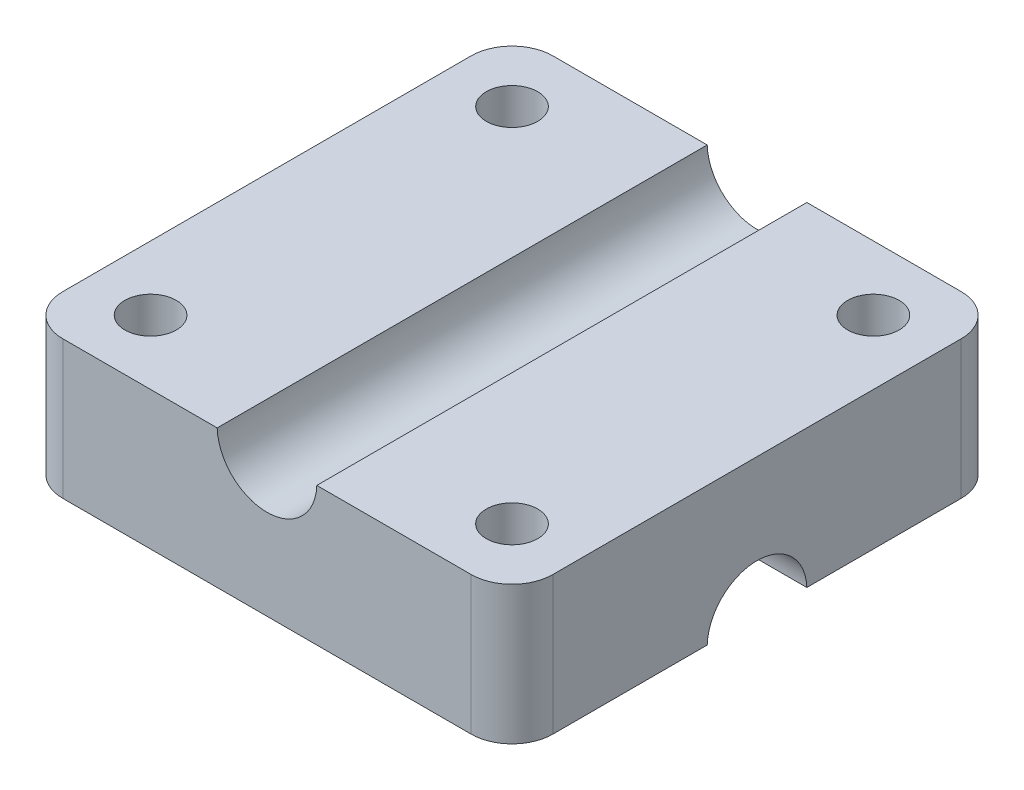
ISO-10303-21;
HEADER;
FILE_DESCRIPTION(('STEP AP214'),'2;1');
FILE_NAME('part.step','',(''),(''),'','','');
FILE_SCHEMA(('AUTOMOTIVE_DESIGN { 1 0 10303 214 1 1 1 1 }'));
ENDSEC;
DATA;
#1=APPLICATION_CONTEXT('core data for automotive mechanical design processes');
#2=APPLICATION_PROTOCOL_DEFINITION('international standard','automotive_design',2000,#1);
#3=PRODUCT_CONTEXT('',#1,'mechanical');
#4=PRODUCT('Part','Part','',(#3));
#5=PRODUCT_RELATED_PRODUCT_CATEGORY('part','',(#4));
#6=PRODUCT_DEFINITION_FORMATION('','',#4);
#7=PRODUCT_DEFINITION_CONTEXT('part definition',#1,'design');
#8=PRODUCT_DEFINITION('design','',#6,#7);
#9=PRODUCT_DEFINITION_SHAPE('','',#8);
#10=(LENGTH_UNIT() NAMED_UNIT(*) SI_UNIT(.MILLI.,.METRE.));
#11=(NAMED_UNIT(*) PLANE_ANGLE_UNIT() SI_UNIT($,.RADIAN.));
#12=(NAMED_UNIT(*) SI_UNIT($,.STERADIAN.) SOLID_ANGLE_UNIT());
#13=UNCERTAINTY_MEASURE_WITH_UNIT(LENGTH_MEASURE(1.E-05),#10,'distance_accuracy_value','');
#14=(GEOMETRIC_REPRESENTATION_CONTEXT(3) GLOBAL_UNCERTAINTY_ASSIGNED_CONTEXT((#13)) GLOBAL_UNIT_ASSIGNED_CONTEXT((#10,
#11,#12)) REPRESENTATION_CONTEXT('',''));
#15=CARTESIAN_POINT('',(0.,0.,0.));
#16=DIRECTION('',(0.,0.,1.));
#17=DIRECTION('',(1.,0.,0.));
#18=AXIS2_PLACEMENT_3D('',#15,#16,#17);
#19=CARTESIAN_POINT('',(0.,0.,0.));
#20=DIRECTION('',(0.,-1.,0.));
#21=DIRECTION('',(0.,0.,-1.));
#22=AXIS2_PLACEMENT_3D('',#19,#20,#21);
#23=PLANE('',#22);
#24=CARTESIAN_POINT('',(-11.24,0.,-11.24));
#25=DIRECTION('',(0.,-1.,0.));
#26=DIRECTION('',(0.,0.,-1.));
#27=AXIS2_PLACEMENT_3D('',#24,#25,#26);
#28=CIRCLE('',#27,1.6);
#29=CARTESIAN_POINT('',(-11.24,0.,-12.84));
#30=VERTEX_POINT('',#29);
#31=EDGE_CURVE('E434',#30,#30,#28,.T.);
#32=ORIENTED_EDGE('',*,*,#31,.F.);
#33=EDGE_LOOP('',(#32));
#34=FACE_BOUND('',#33,.T.);
#35=CARTESIAN_POINT('',(11.24,0.,-11.24));
#36=DIRECTION('',(0.,-1.,0.));
#37=DIRECTION('',(0.,0.,-1.));
#38=AXIS2_PLACEMENT_3D('',#35,#36,#37);
#39=CIRCLE('',#38,1.6);
#40=CARTESIAN_POINT('',(11.24,0.,-12.84));
#41=VERTEX_POINT('',#40);
#42=EDGE_CURVE('E427',#41,#41,#39,.T.);
#43=ORIENTED_EDGE('',*,*,#42,.F.);
#44=EDGE_LOOP('',(#43));
#45=FACE_BOUND('',#44,.T.);
#46=DIRECTION('',(-1.,0.,0.));
#47=VECTOR('',#46,1.);
#48=CARTESIAN_POINT('',(-15.24,0.,-15.24));
#49=LINE('',#48,#47);
#50=CARTESIAN_POINT('',(12.7,0.,-15.24));
#51=VERTEX_POINT('',#50);
#52=CARTESIAN_POINT('',(-12.7,0.,-15.24));
#53=VERTEX_POINT('',#52);
#54=EDGE_CURVE('E148',#51,#53,#49,.T.);
#55=ORIENTED_EDGE('',*,*,#54,.F.);
#56=CARTESIAN_POINT('',(12.7,0.,-12.7));
#57=DIRECTION('',(0.,-1.,0.));
#58=DIRECTION('',(0.,0.,-1.));
#59=AXIS2_PLACEMENT_3D('',#56,#57,#58);
#60=CIRCLE('',#59,2.54);
#61=CARTESIAN_POINT('',(15.24,0.,-12.7));
#62=VERTEX_POINT('',#61);
#63=EDGE_CURVE('E190',#51,#62,#60,.T.);
#64=ORIENTED_EDGE('',*,*,#63,.T.);
#65=DIRECTION('',(0.,0.,-1.));
#66=VECTOR('',#65,1.);
#67=CARTESIAN_POINT('',(15.24,0.,15.24));
#68=LINE('',#67,#66);
#69=CARTESIAN_POINT('',(15.24,0.,-3.09838667696593));
#70=VERTEX_POINT('',#69);
#71=EDGE_CURVE('E258',#70,#62,#68,.T.);
#72=ORIENTED_EDGE('',*,*,#71,.F.);
#73=DIRECTION('',(1.,0.,0.));
#74=VECTOR('',#73,1.);
#75=CARTESIAN_POINT('',(-24.0081240867132,0.,-3.09838667696593));
#76=LINE('',#75,#74);
#77=CARTESIAN_POINT('',(-15.24,0.,-3.09838667696593));
#78=VERTEX_POINT('',#77);
#79=EDGE_CURVE('E135',#78,#70,#76,.T.);
#80=ORIENTED_EDGE('',*,*,#79,.F.);
#81=DIRECTION('',(0.,0.,1.));
#82=VECTOR('',#81,1.);
#83=CARTESIAN_POINT('',(-15.24,0.,15.24));
#84=LINE('',#83,#82);
#85=CARTESIAN_POINT('',(-15.24,0.,-12.7));
#86=VERTEX_POINT('',#85);
#87=EDGE_CURVE('E142',#86,#78,#84,.T.);
#88=ORIENTED_EDGE('',*,*,#87,.F.);
#89=CARTESIAN_POINT('',(-12.7,0.,-12.7));
#90=DIRECTION('',(0.,-1.,0.));
#91=DIRECTION('',(0.,0.,-1.));
#92=AXIS2_PLACEMENT_3D('',#89,#90,#91);
#93=CIRCLE('',#92,2.54);
#94=EDGE_CURVE('E188',#86,#53,#93,.T.);
#95=ORIENTED_EDGE('',*,*,#94,.T.);
#96=EDGE_LOOP('',(#55,#64,#72,#80,#88,#95));
#97=FACE_BOUND('',#96,.T.);
#98=ADVANCED_FACE('F35',(#34,#45,#97),#23,.T.);
#99=CARTESIAN_POINT('',(0.,8.6,0.));
#100=DIRECTION('',(0.,-1.,0.));
#101=DIRECTION('',(0.,0.,-1.));
#102=AXIS2_PLACEMENT_3D('',#99,#100,#101);
#103=PLANE('',#102);
#104=CARTESIAN_POINT('',(11.24,8.6,-11.24));
#105=DIRECTION('',(0.,-1.,0.));
#106=DIRECTION('',(0.,0.,-1.));
#107=AXIS2_PLACEMENT_3D('',#104,#105,#106);
#108=CIRCLE('',#107,1.6);
#109=CARTESIAN_POINT('',(11.24,8.6,-12.84));
#110=VERTEX_POINT('',#109);
#111=EDGE_CURVE('E424',#110,#110,#108,.T.);
#112=ORIENTED_EDGE('',*,*,#111,.T.);
#113=EDGE_LOOP('',(#112));
#114=FACE_BOUND('',#113,.T.);
#115=CARTESIAN_POINT('',(11.24,8.6,11.24));
#116=DIRECTION('',(0.,-1.,0.));
#117=DIRECTION('',(0.,0.,-1.));
#118=AXIS2_PLACEMENT_3D('',#115,#116,#117);
#119=CIRCLE('',#118,1.6);
#120=CARTESIAN_POINT('',(11.24,8.6,9.64));
#121=VERTEX_POINT('',#120);
#122=EDGE_CURVE('E246',#121,#121,#119,.T.);
#123=ORIENTED_EDGE('',*,*,#122,.T.);
#124=EDGE_LOOP('',(#123));
#125=FACE_BOUND('',#124,.T.);
#126=DIRECTION('',(1.,0.,0.));
#127=VECTOR('',#126,1.);
#128=CARTESIAN_POINT('',(-15.24,8.6,15.24));
#129=LINE('',#128,#127);
#130=CARTESIAN_POINT('',(3.09838667696593,8.6,15.24));
#131=VERTEX_POINT('',#130);
#132=CARTESIAN_POINT('',(12.7,8.6,15.24));
#133=VERTEX_POINT('',#132);
#134=EDGE_CURVE('E205',#131,#133,#129,.T.);
#135=ORIENTED_EDGE('',*,*,#134,.T.);
#136=CARTESIAN_POINT('',(12.7,8.6,12.7));
#137=DIRECTION('',(0.,-1.,0.));
#138=DIRECTION('',(0.,0.,-1.));
#139=AXIS2_PLACEMENT_3D('',#136,#137,#138);
#140=CIRCLE('',#139,2.54);
#141=CARTESIAN_POINT('',(15.24,8.6,12.7));
#142=VERTEX_POINT('',#141);
#143=EDGE_CURVE('E181',#133,#142,#140,.F.);
#144=ORIENTED_EDGE('',*,*,#143,.T.);
#145=DIRECTION('',(0.,0.,-1.));
#146=VECTOR('',#145,1.);
#147=CARTESIAN_POINT('',(15.24,8.6,15.24));
#148=LINE('',#147,#146);
#149=CARTESIAN_POINT('',(15.24,8.6,-12.7));
#150=VERTEX_POINT('',#149);
#151=EDGE_CURVE('E158',#142,#150,#148,.T.);
#152=ORIENTED_EDGE('',*,*,#151,.T.);
#153=CARTESIAN_POINT('',(12.7,8.6,-12.7));
#154=DIRECTION('',(0.,-1.,0.));
#155=DIRECTION('',(0.,0.,-1.));
#156=AXIS2_PLACEMENT_3D('',#153,#154,#155);
#157=CIRCLE('',#156,2.54);
#158=CARTESIAN_POINT('',(12.7,8.6,-15.24));
#159=VERTEX_POINT('',#158);
#160=EDGE_CURVE('E179',#150,#159,#157,.F.);
#161=ORIENTED_EDGE('',*,*,#160,.T.);
#162=DIRECTION('',(-1.,0.,0.));
#163=VECTOR('',#162,1.);
#164=CARTESIAN_POINT('',(-15.24,8.6,-15.24));
#165=LINE('',#164,#163);
#166=CARTESIAN_POINT('',(3.09838667696593,8.6,-15.24));
#167=VERTEX_POINT('',#166);
#168=EDGE_CURVE('E262',#159,#167,#165,.T.);
#169=ORIENTED_EDGE('',*,*,#168,.T.);
#170=DIRECTION('',(0.,0.,1.));
#171=VECTOR('',#170,1.);
#172=CARTESIAN_POINT('',(3.09838667696593,8.6,-24.0081240867132));
#173=LINE('',#172,#171);
#174=EDGE_CURVE('E136',#167,#131,#173,.T.);
#175=ORIENTED_EDGE('',*,*,#174,.T.);
#176=EDGE_LOOP('',(#135,#144,#152,#161,#169,#175));
#177=FACE_BOUND('',#176,.T.);
#178=ADVANCED_FACE('F215',(#114,#125,#177),#103,.F.);
#179=CARTESIAN_POINT('',(15.24,8.6,15.24));
#180=DIRECTION('',(-1.,0.,0.));
#181=DIRECTION('',(0.,0.,1.));
#182=AXIS2_PLACEMENT_3D('',#179,#180,#181);
#183=PLANE('',#182);
#184=ORIENTED_EDGE('',*,*,#151,.F.);
#185=DIRECTION('',(0.,-1.,0.));
#186=VECTOR('',#185,1.);
#187=CARTESIAN_POINT('',(15.24,8.6,12.7));
#188=LINE('',#187,#186);
#189=CARTESIAN_POINT('',(15.24,0.,12.7));
#190=VERTEX_POINT('',#189);
#191=EDGE_CURVE('E168',#142,#190,#188,.T.);
#192=ORIENTED_EDGE('',*,*,#191,.T.);
#193=CARTESIAN_POINT('',(15.24,0.,3.09838667696593));
#194=VERTEX_POINT('',#193);
#195=EDGE_CURVE('E152',#190,#194,#68,.T.);
#196=ORIENTED_EDGE('',*,*,#195,.T.);
#197=CARTESIAN_POINT('',(15.24,-0.0999999999999994,0.));
#198=DIRECTION('',(1.,0.,0.));
#199=DIRECTION('',(0.,0.,-1.));
#200=AXIS2_PLACEMENT_3D('',#197,#198,#199);
#201=CIRCLE('',#200,3.1);
#202=EDGE_CURVE('E131',#70,#194,#201,.T.);
#203=ORIENTED_EDGE('',*,*,#202,.F.);
#204=ORIENTED_EDGE('',*,*,#71,.T.);
#205=DIRECTION('',(0.,-1.,0.));
#206=VECTOR('',#205,1.);
#207=CARTESIAN_POINT('',(15.24,8.6,-12.7));
#208=LINE('',#207,#206);
#209=EDGE_CURVE('E166',#62,#150,#208,.F.);
#210=ORIENTED_EDGE('',*,*,#209,.T.);
#211=EDGE_LOOP('',(#184,#192,#196,#203,#204,#210));
#212=FACE_BOUND('',#211,.T.);
#213=ADVANCED_FACE('F221',(#212),#183,.F.);
#214=CARTESIAN_POINT('',(-15.24,8.6,-15.24));
#215=DIRECTION('',(0.,0.,1.));
#216=DIRECTION('',(1.,0.,0.));
#217=AXIS2_PLACEMENT_3D('',#214,#215,#216);
#218=PLANE('',#217);
#219=ORIENTED_EDGE('',*,*,#168,.F.);
#220=DIRECTION('',(0.,-1.,0.));
#221=VECTOR('',#220,1.);
#222=CARTESIAN_POINT('',(12.7,8.6,-15.24));
#223=LINE('',#222,#221);
#224=EDGE_CURVE('E185',#159,#51,#223,.T.);
#225=ORIENTED_EDGE('',*,*,#224,.T.);
#226=ORIENTED_EDGE('',*,*,#54,.T.);
#227=DIRECTION('',(0.,-1.,0.));
#228=VECTOR('',#227,1.);
#229=CARTESIAN_POINT('',(-12.7,8.6,-15.24));
#230=LINE('',#229,#228);
#231=CARTESIAN_POINT('',(-12.7,8.6,-15.24));
#232=VERTEX_POINT('',#231);
#233=EDGE_CURVE('E183',#53,#232,#230,.F.);
#234=ORIENTED_EDGE('',*,*,#233,.T.);
#235=CARTESIAN_POINT('',(-3.09838667696593,8.6,-15.24));
#236=VERTEX_POINT('',#235);
#237=EDGE_CURVE('E261',#236,#232,#165,.T.);
#238=ORIENTED_EDGE('',*,*,#237,.F.);
#239=CARTESIAN_POINT('',(0.,8.7,-15.24));
#240=DIRECTION('',(0.,0.,1.));
#241=DIRECTION('',(1.,0.,0.));
#242=AXIS2_PLACEMENT_3D('',#239,#240,#241);
#243=CIRCLE('',#242,3.1);
#244=EDGE_CURVE('E256',#167,#236,#243,.F.);
#245=ORIENTED_EDGE('',*,*,#244,.F.);
#246=EDGE_LOOP('',(#219,#225,#226,#234,#238,#245));
#247=FACE_BOUND('',#246,.T.);
#248=ADVANCED_FACE('F279',(#247),#218,.F.);
#249=CARTESIAN_POINT('',(-15.24,8.6,15.24));
#250=DIRECTION('',(1.,0.,0.));
#251=DIRECTION('',(0.,0.,-1.));
#252=AXIS2_PLACEMENT_3D('',#249,#250,#251);
#253=PLANE('',#252);
#254=DIRECTION('',(0.,0.,1.));
#255=VECTOR('',#254,1.);
#256=CARTESIAN_POINT('',(-15.24,8.6,15.24));
#257=LINE('',#256,#255);
#258=CARTESIAN_POINT('',(-15.24,8.6,-12.7));
#259=VERTEX_POINT('',#258);
#260=CARTESIAN_POINT('',(-15.24,8.6,12.7));
#261=VERTEX_POINT('',#260);
#262=EDGE_CURVE('E198',#259,#261,#257,.T.);
#263=ORIENTED_EDGE('',*,*,#262,.F.);
#264=DIRECTION('',(0.,-1.,0.));
#265=VECTOR('',#264,1.);
#266=CARTESIAN_POINT('',(-15.24,8.6,-12.7));
#267=LINE('',#266,#265);
#268=EDGE_CURVE('E193',#259,#86,#267,.T.);
#269=ORIENTED_EDGE('',*,*,#268,.T.);
#270=ORIENTED_EDGE('',*,*,#87,.T.);
#271=CARTESIAN_POINT('',(-15.24,-0.0999999999999994,0.));
#272=DIRECTION('',(1.,0.,0.));
#273=DIRECTION('',(0.,0.,-1.));
#274=AXIS2_PLACEMENT_3D('',#271,#272,#273);
#275=CIRCLE('',#274,3.1);
#276=CARTESIAN_POINT('',(-15.24,0.,3.09838667696593));
#277=VERTEX_POINT('',#276);
#278=EDGE_CURVE('E128',#277,#78,#275,.F.);
#279=ORIENTED_EDGE('',*,*,#278,.F.);
#280=CARTESIAN_POINT('',(-15.24,0.,12.7));
#281=VERTEX_POINT('',#280);
#282=EDGE_CURVE('E139',#277,#281,#84,.T.);
#283=ORIENTED_EDGE('',*,*,#282,.T.);
#284=DIRECTION('',(0.,-1.,0.));
#285=VECTOR('',#284,1.);
#286=CARTESIAN_POINT('',(-15.24,8.6,12.7));
#287=LINE('',#286,#285);
#288=EDGE_CURVE('E50',#281,#261,#287,.F.);
#289=ORIENTED_EDGE('',*,*,#288,.T.);
#290=EDGE_LOOP('',(#263,#269,#270,#279,#283,#289));
#291=FACE_BOUND('',#290,.T.);
#292=ADVANCED_FACE('F138',(#291),#253,.F.);
#293=CARTESIAN_POINT('',(-15.24,8.6,15.24));
#294=DIRECTION('',(0.,0.,-1.));
#295=DIRECTION('',(-1.,0.,0.));
#296=AXIS2_PLACEMENT_3D('',#293,#294,#295);
#297=PLANE('',#296);
#298=DIRECTION('',(1.,0.,0.));
#299=VECTOR('',#298,1.);
#300=CARTESIAN_POINT('',(-15.24,0.,15.24));
#301=LINE('',#300,#299);
#302=CARTESIAN_POINT('',(-12.7,0.,15.24));
#303=VERTEX_POINT('',#302);
#304=CARTESIAN_POINT('',(12.7,0.,15.24));
#305=VERTEX_POINT('',#304);
#306=EDGE_CURVE('E150',#303,#305,#301,.T.);
#307=ORIENTED_EDGE('',*,*,#306,.T.);
#308=DIRECTION('',(0.,-1.,0.));
#309=VECTOR('',#308,1.);
#310=CARTESIAN_POINT('',(12.7,8.6,15.24));
#311=LINE('',#310,#309);
#312=EDGE_CURVE('E177',#305,#133,#311,.F.);
#313=ORIENTED_EDGE('',*,*,#312,.T.);
#314=ORIENTED_EDGE('',*,*,#134,.F.);
#315=CARTESIAN_POINT('',(0.,8.7,15.24));
#316=DIRECTION('',(0.,0.,1.));
#317=DIRECTION('',(1.,0.,0.));
#318=AXIS2_PLACEMENT_3D('',#315,#316,#317);
#319=CIRCLE('',#318,3.1);
#320=CARTESIAN_POINT('',(-3.09838667696593,8.6,15.24));
#321=VERTEX_POINT('',#320);
#322=EDGE_CURVE('E143',#321,#131,#319,.T.);
#323=ORIENTED_EDGE('',*,*,#322,.F.);
#324=CARTESIAN_POINT('',(-12.7,8.6,15.24));
#325=VERTEX_POINT('',#324);
#326=EDGE_CURVE('E162',#325,#321,#129,.T.);
#327=ORIENTED_EDGE('',*,*,#326,.F.);
#328=DIRECTION('',(0.,-1.,0.));
#329=VECTOR('',#328,1.);
#330=CARTESIAN_POINT('',(-12.7,8.6,15.24));
#331=LINE('',#330,#329);
#332=EDGE_CURVE('E174',#325,#303,#331,.T.);
#333=ORIENTED_EDGE('',*,*,#332,.T.);
#334=EDGE_LOOP('',(#307,#313,#314,#323,#327,#333));
#335=FACE_BOUND('',#334,.T.);
#336=ADVANCED_FACE('F203',(#335),#297,.F.);
#337=CARTESIAN_POINT('',(-11.24,8.6,-11.24));
#338=DIRECTION('',(0.,-1.,0.));
#339=DIRECTION('',(0.,0.,-1.));
#340=AXIS2_PLACEMENT_3D('',#337,#338,#339);
#341=CIRCLE('',#340,1.6);
#342=CARTESIAN_POINT('',(-11.24,8.6,-12.84));
#343=VERTEX_POINT('',#342);
#344=EDGE_CURVE('E432',#343,#343,#341,.T.);
#345=ORIENTED_EDGE('',*,*,#344,.T.);
#346=EDGE_LOOP('',(#345));
#347=FACE_BOUND('',#346,.T.);
#348=CARTESIAN_POINT('',(-11.24,8.6,11.24));
#349=DIRECTION('',(0.,-1.,0.));
#350=DIRECTION('',(0.,0.,-1.));
#351=AXIS2_PLACEMENT_3D('',#348,#349,#350);
#352=CIRCLE('',#351,1.6);
#353=CARTESIAN_POINT('',(-11.24,8.6,9.64));
#354=VERTEX_POINT('',#353);
#355=EDGE_CURVE('E245',#354,#354,#352,.T.);
#356=ORIENTED_EDGE('',*,*,#355,.T.);
#357=EDGE_LOOP('',(#356));
#358=FACE_BOUND('',#357,.T.);
#359=ORIENTED_EDGE('',*,*,#237,.T.);
#360=CARTESIAN_POINT('',(-12.7,8.6,-12.7));
#361=DIRECTION('',(0.,-1.,0.));
#362=DIRECTION('',(0.,0.,-1.));
#363=AXIS2_PLACEMENT_3D('',#360,#361,#362);
#364=CIRCLE('',#363,2.54);
#365=EDGE_CURVE('E11',#232,#259,#364,.F.);
#366=ORIENTED_EDGE('',*,*,#365,.T.);
#367=ORIENTED_EDGE('',*,*,#262,.T.);
#368=CARTESIAN_POINT('',(-12.7,8.6,12.7));
#369=DIRECTION('',(0.,-1.,0.));
#370=DIRECTION('',(0.,0.,-1.));
#371=AXIS2_PLACEMENT_3D('',#368,#369,#370);
#372=CIRCLE('',#371,2.54);
#373=EDGE_CURVE('E43',#261,#325,#372,.F.);
#374=ORIENTED_EDGE('',*,*,#373,.T.);
#375=ORIENTED_EDGE('',*,*,#326,.T.);
#376=DIRECTION('',(0.,0.,1.));
#377=VECTOR('',#376,1.);
#378=CARTESIAN_POINT('',(-3.09838667696593,8.6,-24.0081240867132));
#379=LINE('',#378,#377);
#380=EDGE_CURVE('E159',#321,#236,#379,.F.);
#381=ORIENTED_EDGE('',*,*,#380,.T.);
#382=EDGE_LOOP('',(#359,#366,#367,#374,#375,#381));
#383=FACE_BOUND('',#382,.T.);
#384=ADVANCED_FACE('F196',(#347,#358,#383),#103,.F.);
#385=CARTESIAN_POINT('',(11.24,0.,11.24));
#386=DIRECTION('',(0.,-1.,0.));
#387=DIRECTION('',(0.,0.,-1.));
#388=AXIS2_PLACEMENT_3D('',#385,#386,#387);
#389=CIRCLE('',#388,1.6);
#390=CARTESIAN_POINT('',(11.24,0.,9.64));
#391=VERTEX_POINT('',#390);
#392=EDGE_CURVE('E240',#391,#391,#389,.T.);
#393=ORIENTED_EDGE('',*,*,#392,.F.);
#394=EDGE_LOOP('',(#393));
#395=FACE_BOUND('',#394,.T.);
#396=CARTESIAN_POINT('',(-11.24,0.,11.24));
#397=DIRECTION('',(0.,-1.,0.));
#398=DIRECTION('',(0.,0.,-1.));
#399=AXIS2_PLACEMENT_3D('',#396,#397,#398);
#400=CIRCLE('',#399,1.6);
#401=CARTESIAN_POINT('',(-11.24,0.,9.64));
#402=VERTEX_POINT('',#401);
#403=EDGE_CURVE('E243',#402,#402,#400,.T.);
#404=ORIENTED_EDGE('',*,*,#403,.F.);
#405=EDGE_LOOP('',(#404));
#406=FACE_BOUND('',#405,.T.);
#407=ORIENTED_EDGE('',*,*,#195,.F.);
#408=CARTESIAN_POINT('',(12.7,0.,12.7));
#409=DIRECTION('',(0.,-1.,0.));
#410=DIRECTION('',(0.,0.,-1.));
#411=AXIS2_PLACEMENT_3D('',#408,#409,#410);
#412=CIRCLE('',#411,2.54);
#413=EDGE_CURVE('E172',#190,#305,#412,.T.);
#414=ORIENTED_EDGE('',*,*,#413,.T.);
#415=ORIENTED_EDGE('',*,*,#306,.F.);
#416=CARTESIAN_POINT('',(-12.7,0.,12.7));
#417=DIRECTION('',(0.,-1.,0.));
#418=DIRECTION('',(0.,0.,-1.));
#419=AXIS2_PLACEMENT_3D('',#416,#417,#418);
#420=CIRCLE('',#419,2.54);
#421=EDGE_CURVE('E147',#303,#281,#420,.T.);
#422=ORIENTED_EDGE('',*,*,#421,.T.);
#423=ORIENTED_EDGE('',*,*,#282,.F.);
#424=DIRECTION('',(1.,0.,0.));
#425=VECTOR('',#424,1.);
#426=CARTESIAN_POINT('',(-24.0081240867132,0.,3.09838667696593));
#427=LINE('',#426,#425);
#428=EDGE_CURVE('E125',#194,#277,#427,.F.);
#429=ORIENTED_EDGE('',*,*,#428,.F.);
#430=EDGE_LOOP('',(#407,#414,#415,#422,#423,#429));
#431=FACE_BOUND('',#430,.T.);
#432=ADVANCED_FACE('F145',(#395,#406,#431),#23,.T.);
#433=CARTESIAN_POINT('',(0.,8.7,-24.0081240867132));
#434=DIRECTION('',(0.,0.,1.));
#435=DIRECTION('',(1.,0.,0.));
#436=AXIS2_PLACEMENT_3D('',#433,#434,#435);
#437=CYLINDRICAL_SURFACE('',#436,3.1);
#438=ORIENTED_EDGE('',*,*,#244,.T.);
#439=ORIENTED_EDGE('',*,*,#380,.F.);
#440=ORIENTED_EDGE('',*,*,#322,.T.);
#441=ORIENTED_EDGE('',*,*,#174,.F.);
#442=EDGE_LOOP('',(#438,#439,#440,#441));
#443=FACE_BOUND('',#442,.T.);
#444=ADVANCED_FACE('F228',(#443),#437,.F.);
#445=CARTESIAN_POINT('',(-24.0081240867132,-0.0999999999999994,0.));
#446=DIRECTION('',(1.,0.,0.));
#447=DIRECTION('',(0.,0.,-1.));
#448=AXIS2_PLACEMENT_3D('',#445,#446,#447);
#449=CYLINDRICAL_SURFACE('',#448,3.1);
#450=ORIENTED_EDGE('',*,*,#79,.T.);
#451=ORIENTED_EDGE('',*,*,#202,.T.);
#452=ORIENTED_EDGE('',*,*,#428,.T.);
#453=ORIENTED_EDGE('',*,*,#278,.T.);
#454=EDGE_LOOP('',(#450,#451,#452,#453));
#455=FACE_BOUND('',#454,.T.);
#456=ADVANCED_FACE('F127',(#455),#449,.F.);
#457=CARTESIAN_POINT('',(-11.24,8.6,11.24));
#458=DIRECTION('',(0.,-1.,0.));
#459=DIRECTION('',(0.,0.,-1.));
#460=AXIS2_PLACEMENT_3D('',#457,#458,#459);
#461=CYLINDRICAL_SURFACE('',#460,1.6);
#462=ORIENTED_EDGE('',*,*,#355,.F.);
#463=EDGE_LOOP('',(#462));
#464=FACE_BOUND('',#463,.T.);
#465=ORIENTED_EDGE('',*,*,#403,.T.);
#466=EDGE_LOOP('',(#465));
#467=FACE_BOUND('',#466,.T.);
#468=ADVANCED_FACE('F364',(#464,#467),#461,.F.);
#469=CARTESIAN_POINT('',(11.24,8.6,11.24));
#470=DIRECTION('',(0.,-1.,0.));
#471=DIRECTION('',(0.,0.,-1.));
#472=AXIS2_PLACEMENT_3D('',#469,#470,#471);
#473=CYLINDRICAL_SURFACE('',#472,1.6);
#474=ORIENTED_EDGE('',*,*,#122,.F.);
#475=EDGE_LOOP('',(#474));
#476=FACE_BOUND('',#475,.T.);
#477=ORIENTED_EDGE('',*,*,#392,.T.);
#478=EDGE_LOOP('',(#477));
#479=FACE_BOUND('',#478,.T.);
#480=ADVANCED_FACE('F355',(#476,#479),#473,.F.);
#481=CARTESIAN_POINT('',(-11.24,8.6,-11.24));
#482=DIRECTION('',(0.,-1.,0.));
#483=DIRECTION('',(0.,0.,-1.));
#484=AXIS2_PLACEMENT_3D('',#481,#482,#483);
#485=CYLINDRICAL_SURFACE('',#484,1.6);
#486=ORIENTED_EDGE('',*,*,#344,.F.);
#487=EDGE_LOOP('',(#486));
#488=FACE_BOUND('',#487,.T.);
#489=ORIENTED_EDGE('',*,*,#31,.T.);
#490=EDGE_LOOP('',(#489));
#491=FACE_BOUND('',#490,.T.);
#492=ADVANCED_FACE('F297',(#488,#491),#485,.F.);
#493=CARTESIAN_POINT('',(11.24,8.6,-11.24));
#494=DIRECTION('',(0.,-1.,0.));
#495=DIRECTION('',(0.,0.,-1.));
#496=AXIS2_PLACEMENT_3D('',#493,#494,#495);
#497=CYLINDRICAL_SURFACE('',#496,1.6);
#498=ORIENTED_EDGE('',*,*,#111,.F.);
#499=EDGE_LOOP('',(#498));
#500=FACE_BOUND('',#499,.T.);
#501=ORIENTED_EDGE('',*,*,#42,.T.);
#502=EDGE_LOOP('',(#501));
#503=FACE_BOUND('',#502,.T.);
#504=ADVANCED_FACE('F290',(#500,#503),#497,.F.);
#505=CARTESIAN_POINT('',(12.7,8.6,12.7));
#506=DIRECTION('',(0.,-1.,0.));
#507=DIRECTION('',(0.,0.,-1.));
#508=AXIS2_PLACEMENT_3D('',#505,#506,#507);
#509=CYLINDRICAL_SURFACE('',#508,2.54);
#510=ORIENTED_EDGE('',*,*,#143,.F.);
#511=ORIENTED_EDGE('',*,*,#312,.F.);
#512=ORIENTED_EDGE('',*,*,#413,.F.);
#513=ORIENTED_EDGE('',*,*,#191,.F.);
#514=EDGE_LOOP('',(#510,#511,#512,#513));
#515=FACE_BOUND('',#514,.T.);
#516=ADVANCED_FACE('F287',(#515),#509,.T.);
#517=CARTESIAN_POINT('',(12.7,8.6,-12.7));
#518=DIRECTION('',(0.,-1.,0.));
#519=DIRECTION('',(0.,0.,-1.));
#520=AXIS2_PLACEMENT_3D('',#517,#518,#519);
#521=CYLINDRICAL_SURFACE('',#520,2.54);
#522=ORIENTED_EDGE('',*,*,#160,.F.);
#523=ORIENTED_EDGE('',*,*,#209,.F.);
#524=ORIENTED_EDGE('',*,*,#63,.F.);
#525=ORIENTED_EDGE('',*,*,#224,.F.);
#526=EDGE_LOOP('',(#522,#523,#524,#525));
#527=FACE_BOUND('',#526,.T.);
#528=ADVANCED_FACE('F212',(#527),#521,.T.);
#529=CARTESIAN_POINT('',(-12.7,8.6,-12.7));
#530=DIRECTION('',(0.,-1.,0.));
#531=DIRECTION('',(0.,0.,-1.));
#532=AXIS2_PLACEMENT_3D('',#529,#530,#531);
#533=CYLINDRICAL_SURFACE('',#532,2.54);
#534=ORIENTED_EDGE('',*,*,#365,.F.);
#535=ORIENTED_EDGE('',*,*,#233,.F.);
#536=ORIENTED_EDGE('',*,*,#94,.F.);
#537=ORIENTED_EDGE('',*,*,#268,.F.);
#538=EDGE_LOOP('',(#534,#535,#536,#537));
#539=FACE_BOUND('',#538,.T.);
#540=ADVANCED_FACE('F208',(#539),#533,.T.);
#541=CARTESIAN_POINT('',(-12.7,8.6,12.7));
#542=DIRECTION('',(0.,-1.,0.));
#543=DIRECTION('',(0.,0.,-1.));
#544=AXIS2_PLACEMENT_3D('',#541,#542,#543);
#545=CYLINDRICAL_SURFACE('',#544,2.54);
#546=ORIENTED_EDGE('',*,*,#373,.F.);
#547=ORIENTED_EDGE('',*,*,#288,.F.);
#548=ORIENTED_EDGE('',*,*,#421,.F.);
#549=ORIENTED_EDGE('',*,*,#332,.F.);
#550=EDGE_LOOP('',(#546,#547,#548,#549));
#551=FACE_BOUND('',#550,.T.);
#552=ADVANCED_FACE('F37',(#551),#545,.T.);
#553=CLOSED_SHELL('',(#98,#178,#213,#248,#292,#336,#384,#432,#444,#456,#468,#480,#492,#504,#516,
#528,#540,#552));
#554=MANIFOLD_SOLID_BREP('B2',#553);
#555=ADVANCED_BREP_SHAPE_REPRESENTATION('',(#18,#554),#14);
#556=SHAPE_DEFINITION_REPRESENTATION(#9,#555);
ENDSEC;
END-ISO-10303-21;
